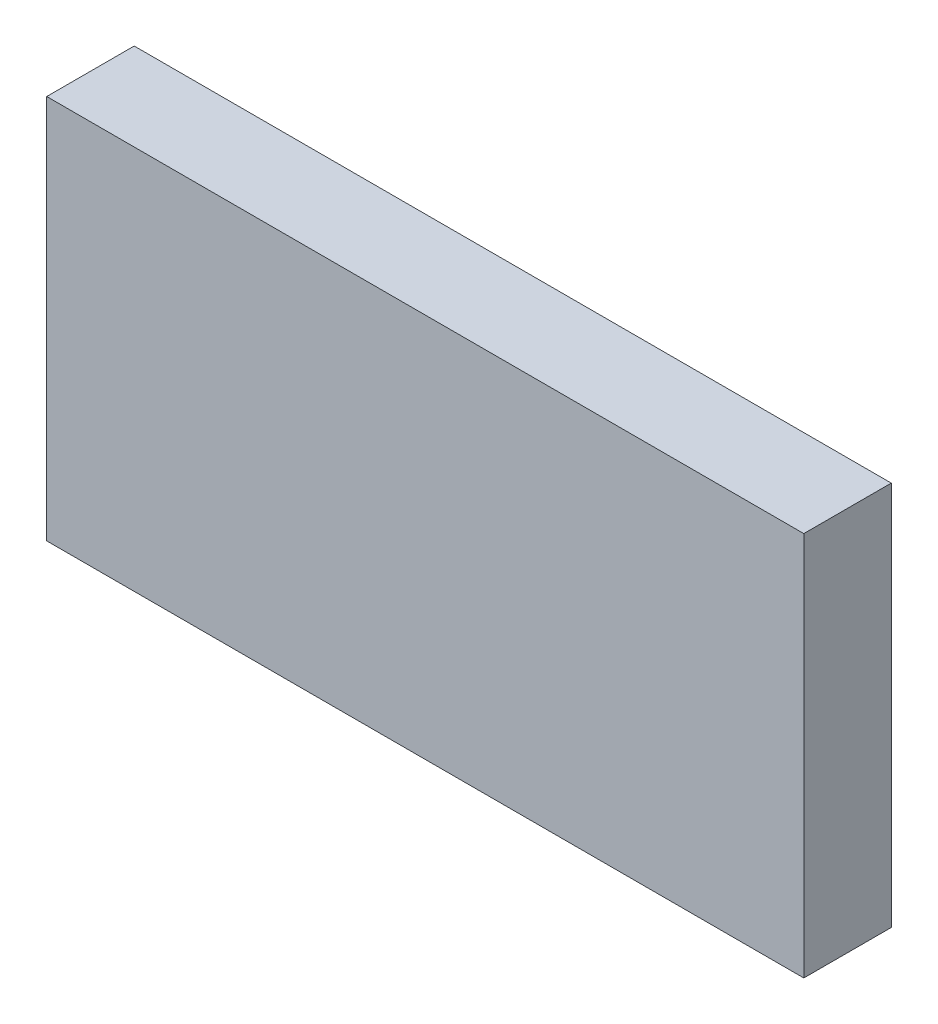
ISO-10303-21;
HEADER;
FILE_DESCRIPTION(('STEP AP214'),'2;1');
FILE_NAME('part.step','',(''),(''),'','','');
FILE_SCHEMA(('AUTOMOTIVE_DESIGN { 1 0 10303 214 1 1 1 1 }'));
ENDSEC;
DATA;
#1=APPLICATION_CONTEXT('core data for automotive mechanical design processes');
#2=APPLICATION_PROTOCOL_DEFINITION('international standard','automotive_design',2000,#1);
#3=PRODUCT_CONTEXT('',#1,'mechanical');
#4=PRODUCT('Part','Part','',(#3));
#5=PRODUCT_RELATED_PRODUCT_CATEGORY('part','',(#4));
#6=PRODUCT_DEFINITION_FORMATION('','',#4);
#7=PRODUCT_DEFINITION_CONTEXT('part definition',#1,'design');
#8=PRODUCT_DEFINITION('design','',#6,#7);
#9=PRODUCT_DEFINITION_SHAPE('','',#8);
#10=(LENGTH_UNIT() NAMED_UNIT(*) SI_UNIT(.MILLI.,.METRE.));
#11=(NAMED_UNIT(*) PLANE_ANGLE_UNIT() SI_UNIT($,.RADIAN.));
#12=(NAMED_UNIT(*) SI_UNIT($,.STERADIAN.) SOLID_ANGLE_UNIT());
#13=UNCERTAINTY_MEASURE_WITH_UNIT(LENGTH_MEASURE(1.E-05),#10,'distance_accuracy_value','');
#14=(GEOMETRIC_REPRESENTATION_CONTEXT(3) GLOBAL_UNCERTAINTY_ASSIGNED_CONTEXT((#13)) GLOBAL_UNIT_ASSIGNED_CONTEXT((#10,
#11,#12)) REPRESENTATION_CONTEXT('',''));
#15=CARTESIAN_POINT('',(0.,0.,0.));
#16=DIRECTION('',(0.,0.,1.));
#17=DIRECTION('',(1.,0.,0.));
#18=AXIS2_PLACEMENT_3D('',#15,#16,#17);
#19=CARTESIAN_POINT('',(-1.445,-2.22,0.));
#20=DIRECTION('',(1.,0.,0.));
#21=DIRECTION('',(0.,0.,1.));
#22=AXIS2_PLACEMENT_3D('',#19,#20,#21);
#23=PLANE('',#22);
#24=DIRECTION('',(0.,1.,0.));
#25=VECTOR('',#24,1.);
#26=CARTESIAN_POINT('',(-1.445,-2.22,0.1));
#27=LINE('',#26,#25);
#28=CARTESIAN_POINT('',(-1.445,-2.22,0.1));
#29=VERTEX_POINT('',#28);
#30=CARTESIAN_POINT('',(-1.445,-1.78,0.1));
#31=VERTEX_POINT('',#30);
#32=EDGE_CURVE('E11',#29,#31,#27,.T.);
#33=ORIENTED_EDGE('',*,*,#32,.T.);
#34=DIRECTION('',(0.,0.,1.));
#35=VECTOR('',#34,1.);
#36=CARTESIAN_POINT('',(-1.445,-1.78,0.));
#37=LINE('',#36,#35);
#38=CARTESIAN_POINT('',(-1.445,-1.78,0.));
#39=VERTEX_POINT('',#38);
#40=EDGE_CURVE('E24',#39,#31,#37,.T.);
#41=ORIENTED_EDGE('',*,*,#40,.F.);
#42=DIRECTION('',(0.,1.,0.));
#43=VECTOR('',#42,1.);
#44=CARTESIAN_POINT('',(-1.445,-2.22,0.));
#45=LINE('',#44,#43);
#46=CARTESIAN_POINT('',(-1.445,-2.22,0.));
#47=VERTEX_POINT('',#46);
#48=EDGE_CURVE('E86',#47,#39,#45,.T.);
#49=ORIENTED_EDGE('',*,*,#48,.F.);
#50=DIRECTION('',(0.,0.,1.));
#51=VECTOR('',#50,1.);
#52=CARTESIAN_POINT('',(-1.445,-2.22,0.));
#53=LINE('',#52,#51);
#54=EDGE_CURVE('E36',#47,#29,#53,.T.);
#55=ORIENTED_EDGE('',*,*,#54,.T.);
#56=EDGE_LOOP('',(#33,#41,#49,#55));
#57=FACE_BOUND('',#56,.T.);
#58=ADVANCED_FACE('F17',(#57),#23,.F.);
#59=CARTESIAN_POINT('',(-0.5795,-2.22,0.));
#60=DIRECTION('',(1.,0.,0.));
#61=DIRECTION('',(0.,0.,1.));
#62=AXIS2_PLACEMENT_3D('',#59,#60,#61);
#63=PLANE('',#62);
#64=DIRECTION('',(0.,0.,1.));
#65=VECTOR('',#64,1.);
#66=CARTESIAN_POINT('',(-0.5795,-2.22,0.));
#67=LINE('',#66,#65);
#68=CARTESIAN_POINT('',(-0.5795,-2.22,0.));
#69=VERTEX_POINT('',#68);
#70=CARTESIAN_POINT('',(-0.5795,-2.22,0.1));
#71=VERTEX_POINT('',#70);
#72=EDGE_CURVE('E83',#69,#71,#67,.T.);
#73=ORIENTED_EDGE('',*,*,#72,.F.);
#74=DIRECTION('',(0.,1.,0.));
#75=VECTOR('',#74,1.);
#76=CARTESIAN_POINT('',(-0.5795,-2.22,0.));
#77=LINE('',#76,#75);
#78=CARTESIAN_POINT('',(-0.5795,-1.78,0.));
#79=VERTEX_POINT('',#78);
#80=EDGE_CURVE('E63',#69,#79,#77,.T.);
#81=ORIENTED_EDGE('',*,*,#80,.T.);
#82=DIRECTION('',(0.,0.,1.));
#83=VECTOR('',#82,1.);
#84=CARTESIAN_POINT('',(-0.5795,-1.78,0.));
#85=LINE('',#84,#83);
#86=CARTESIAN_POINT('',(-0.5795,-1.78,0.1));
#87=VERTEX_POINT('',#86);
#88=EDGE_CURVE('E57',#79,#87,#85,.T.);
#89=ORIENTED_EDGE('',*,*,#88,.T.);
#90=DIRECTION('',(0.,1.,0.));
#91=VECTOR('',#90,1.);
#92=CARTESIAN_POINT('',(-0.5795,-2.22,0.1));
#93=LINE('',#92,#91);
#94=EDGE_CURVE('E60',#71,#87,#93,.T.);
#95=ORIENTED_EDGE('',*,*,#94,.F.);
#96=EDGE_LOOP('',(#73,#81,#89,#95));
#97=FACE_BOUND('',#96,.T.);
#98=ADVANCED_FACE('F59',(#97),#63,.T.);
#99=CARTESIAN_POINT('',(-1.445,-2.22,0.));
#100=DIRECTION('',(0.,1.,0.));
#101=DIRECTION('',(0.,0.,1.));
#102=AXIS2_PLACEMENT_3D('',#99,#100,#101);
#103=PLANE('',#102);
#104=ORIENTED_EDGE('',*,*,#72,.T.);
#105=DIRECTION('',(1.,0.,0.));
#106=VECTOR('',#105,1.);
#107=CARTESIAN_POINT('',(-1.445,-2.22,0.1));
#108=LINE('',#107,#106);
#109=EDGE_CURVE('E71',#29,#71,#108,.T.);
#110=ORIENTED_EDGE('',*,*,#109,.F.);
#111=ORIENTED_EDGE('',*,*,#54,.F.);
#112=DIRECTION('',(1.,0.,0.));
#113=VECTOR('',#112,1.);
#114=CARTESIAN_POINT('',(-1.445,-2.22,0.));
#115=LINE('',#114,#113);
#116=EDGE_CURVE('E76',#47,#69,#115,.T.);
#117=ORIENTED_EDGE('',*,*,#116,.T.);
#118=EDGE_LOOP('',(#104,#110,#111,#117));
#119=FACE_BOUND('',#118,.T.);
#120=ADVANCED_FACE('F91',(#119),#103,.F.);
#121=CARTESIAN_POINT('',(-1.445,-1.78,0.));
#122=DIRECTION('',(0.,1.,0.));
#123=DIRECTION('',(0.,0.,1.));
#124=AXIS2_PLACEMENT_3D('',#121,#122,#123);
#125=PLANE('',#124);
#126=DIRECTION('',(1.,0.,0.));
#127=VECTOR('',#126,1.);
#128=CARTESIAN_POINT('',(-1.445,-1.78,0.));
#129=LINE('',#128,#127);
#130=EDGE_CURVE('E74',#39,#79,#129,.T.);
#131=ORIENTED_EDGE('',*,*,#130,.F.);
#132=ORIENTED_EDGE('',*,*,#40,.T.);
#133=DIRECTION('',(1.,0.,0.));
#134=VECTOR('',#133,1.);
#135=CARTESIAN_POINT('',(-1.445,-1.78,0.1));
#136=LINE('',#135,#134);
#137=EDGE_CURVE('E69',#31,#87,#136,.T.);
#138=ORIENTED_EDGE('',*,*,#137,.T.);
#139=ORIENTED_EDGE('',*,*,#88,.F.);
#140=EDGE_LOOP('',(#131,#132,#138,#139));
#141=FACE_BOUND('',#140,.T.);
#142=ADVANCED_FACE('F73',(#141),#125,.T.);
#143=CARTESIAN_POINT('',(-1.445,-2.22,0.));
#144=DIRECTION('',(0.,0.,1.));
#145=DIRECTION('',(1.,0.,0.));
#146=AXIS2_PLACEMENT_3D('',#143,#144,#145);
#147=PLANE('',#146);
#148=ORIENTED_EDGE('',*,*,#130,.T.);
#149=ORIENTED_EDGE('',*,*,#80,.F.);
#150=ORIENTED_EDGE('',*,*,#116,.F.);
#151=ORIENTED_EDGE('',*,*,#48,.T.);
#152=EDGE_LOOP('',(#148,#149,#150,#151));
#153=FACE_BOUND('',#152,.T.);
#154=ADVANCED_FACE('F89',(#153),#147,.F.);
#155=CARTESIAN_POINT('',(-1.445,-2.22,0.1));
#156=DIRECTION('',(0.,0.,1.));
#157=DIRECTION('',(1.,0.,0.));
#158=AXIS2_PLACEMENT_3D('',#155,#156,#157);
#159=PLANE('',#158);
#160=ORIENTED_EDGE('',*,*,#32,.F.);
#161=ORIENTED_EDGE('',*,*,#109,.T.);
#162=ORIENTED_EDGE('',*,*,#94,.T.);
#163=ORIENTED_EDGE('',*,*,#137,.F.);
#164=EDGE_LOOP('',(#160,#161,#162,#163));
#165=FACE_BOUND('',#164,.T.);
#166=ADVANCED_FACE('F68',(#165),#159,.T.);
#167=CLOSED_SHELL('',(#58,#98,#120,#142,#154,#166));
#168=MANIFOLD_SOLID_BREP('B1',#167);
#169=ADVANCED_BREP_SHAPE_REPRESENTATION('',(#18,#168),#14);
#170=SHAPE_DEFINITION_REPRESENTATION(#9,#169);
ENDSEC;
END-ISO-10303-21;
